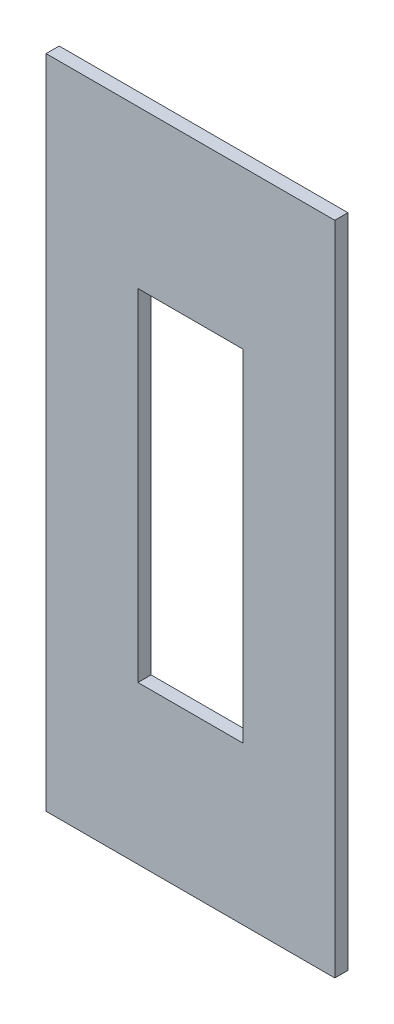
ISO-10303-21;
HEADER;
FILE_DESCRIPTION(('STEP AP214'),'2;1');
FILE_NAME('part.step','',(''),(''),'','','');
FILE_SCHEMA(('AUTOMOTIVE_DESIGN { 1 0 10303 214 1 1 1 1 }'));
ENDSEC;
DATA;
#1=APPLICATION_CONTEXT('core data for automotive mechanical design processes');
#2=APPLICATION_PROTOCOL_DEFINITION('international standard','automotive_design',2000,#1);
#3=PRODUCT_CONTEXT('',#1,'mechanical');
#4=PRODUCT('Part','Part','',(#3));
#5=PRODUCT_RELATED_PRODUCT_CATEGORY('part','',(#4));
#6=PRODUCT_DEFINITION_FORMATION('','',#4);
#7=PRODUCT_DEFINITION_CONTEXT('part definition',#1,'design');
#8=PRODUCT_DEFINITION('design','',#6,#7);
#9=PRODUCT_DEFINITION_SHAPE('','',#8);
#10=(LENGTH_UNIT() NAMED_UNIT(*) SI_UNIT(.MILLI.,.METRE.));
#11=(NAMED_UNIT(*) PLANE_ANGLE_UNIT() SI_UNIT($,.RADIAN.));
#12=(NAMED_UNIT(*) SI_UNIT($,.STERADIAN.) SOLID_ANGLE_UNIT());
#13=UNCERTAINTY_MEASURE_WITH_UNIT(LENGTH_MEASURE(1.E-05),#10,'distance_accuracy_value','');
#14=(GEOMETRIC_REPRESENTATION_CONTEXT(3) GLOBAL_UNCERTAINTY_ASSIGNED_CONTEXT((#13)) GLOBAL_UNIT_ASSIGNED_CONTEXT((#10,
#11,#12)) REPRESENTATION_CONTEXT('',''));
#15=CARTESIAN_POINT('',(0.,0.,0.));
#16=DIRECTION('',(0.,0.,1.));
#17=DIRECTION('',(1.,0.,0.));
#18=AXIS2_PLACEMENT_3D('',#15,#16,#17);
#19=CARTESIAN_POINT('',(0.,6.5,0.5));
#20=DIRECTION('',(0.,1.,0.));
#21=DIRECTION('',(0.,0.,1.));
#22=AXIS2_PLACEMENT_3D('',#19,#20,#21);
#23=PLANE('',#22);
#24=DIRECTION('',(1.,0.,0.));
#25=VECTOR('',#24,1.);
#26=CARTESIAN_POINT('',(0.,6.5,0.));
#27=LINE('',#26,#25);
#28=CARTESIAN_POINT('',(-2.,6.5,0.));
#29=VERTEX_POINT('',#28);
#30=CARTESIAN_POINT('',(2.,6.5,0.));
#31=VERTEX_POINT('',#30);
#32=EDGE_CURVE('E140',#29,#31,#27,.T.);
#33=ORIENTED_EDGE('',*,*,#32,.T.);
#34=DIRECTION('',(0.,0.,-1.));
#35=VECTOR('',#34,1.);
#36=CARTESIAN_POINT('',(2.,6.5,0.5));
#37=LINE('',#36,#35);
#38=CARTESIAN_POINT('',(2.,6.5,0.5));
#39=VERTEX_POINT('',#38);
#40=EDGE_CURVE('E11',#39,#31,#37,.T.);
#41=ORIENTED_EDGE('',*,*,#40,.F.);
#42=DIRECTION('',(1.,0.,0.));
#43=VECTOR('',#42,1.);
#44=CARTESIAN_POINT('',(0.,6.5,0.5));
#45=LINE('',#44,#43);
#46=CARTESIAN_POINT('',(-2.,6.5,0.5));
#47=VERTEX_POINT('',#46);
#48=EDGE_CURVE('E112',#47,#39,#45,.T.);
#49=ORIENTED_EDGE('',*,*,#48,.F.);
#50=DIRECTION('',(0.,0.,-1.));
#51=VECTOR('',#50,1.);
#52=CARTESIAN_POINT('',(-2.,6.5,0.5));
#53=LINE('',#52,#51);
#54=EDGE_CURVE('E52',#47,#29,#53,.T.);
#55=ORIENTED_EDGE('',*,*,#54,.T.);
#56=EDGE_LOOP('',(#33,#41,#49,#55));
#57=FACE_BOUND('',#56,.T.);
#58=ADVANCED_FACE('F33',(#57),#23,.F.);
#59=CARTESIAN_POINT('',(2.,-21.3859500636481,0.5));
#60=DIRECTION('',(1.,0.,0.));
#61=DIRECTION('',(0.,1.,0.));
#62=AXIS2_PLACEMENT_3D('',#59,#60,#61);
#63=PLANE('',#62);
#64=DIRECTION('',(0.,-1.,0.));
#65=VECTOR('',#64,1.);
#66=CARTESIAN_POINT('',(2.,-21.3859500636481,0.));
#67=LINE('',#66,#65);
#68=CARTESIAN_POINT('',(2.,-6.5,0.));
#69=VERTEX_POINT('',#68);
#70=EDGE_CURVE('E118',#31,#69,#67,.T.);
#71=ORIENTED_EDGE('',*,*,#70,.T.);
#72=DIRECTION('',(0.,0.,-1.));
#73=VECTOR('',#72,1.);
#74=CARTESIAN_POINT('',(2.,-6.5,0.5));
#75=LINE('',#74,#73);
#76=CARTESIAN_POINT('',(2.,-6.5,0.5));
#77=VERTEX_POINT('',#76);
#78=EDGE_CURVE('E43',#77,#69,#75,.T.);
#79=ORIENTED_EDGE('',*,*,#78,.F.);
#80=DIRECTION('',(0.,-1.,0.));
#81=VECTOR('',#80,1.);
#82=CARTESIAN_POINT('',(2.,-21.3859500636481,0.5));
#83=LINE('',#82,#81);
#84=EDGE_CURVE('E106',#39,#77,#83,.T.);
#85=ORIENTED_EDGE('',*,*,#84,.F.);
#86=ORIENTED_EDGE('',*,*,#40,.T.);
#87=EDGE_LOOP('',(#71,#79,#85,#86));
#88=FACE_BOUND('',#87,.T.);
#89=ADVANCED_FACE('F117',(#88),#63,.F.);
#90=CARTESIAN_POINT('',(0.,-6.5,0.5));
#91=DIRECTION('',(0.,1.,0.));
#92=DIRECTION('',(0.,0.,1.));
#93=AXIS2_PLACEMENT_3D('',#90,#91,#92);
#94=PLANE('',#93);
#95=DIRECTION('',(1.,0.,0.));
#96=VECTOR('',#95,1.);
#97=CARTESIAN_POINT('',(0.,-6.5,0.));
#98=LINE('',#97,#96);
#99=CARTESIAN_POINT('',(-2.,-6.5,0.));
#100=VERTEX_POINT('',#99);
#101=EDGE_CURVE('E143',#100,#69,#98,.T.);
#102=ORIENTED_EDGE('',*,*,#101,.F.);
#103=DIRECTION('',(0.,0.,-1.));
#104=VECTOR('',#103,1.);
#105=CARTESIAN_POINT('',(-2.,-6.5,0.5));
#106=LINE('',#105,#104);
#107=CARTESIAN_POINT('',(-2.,-6.5,0.5));
#108=VERTEX_POINT('',#107);
#109=EDGE_CURVE('E78',#108,#100,#106,.T.);
#110=ORIENTED_EDGE('',*,*,#109,.F.);
#111=DIRECTION('',(1.,0.,0.));
#112=VECTOR('',#111,1.);
#113=CARTESIAN_POINT('',(0.,-6.5,0.5));
#114=LINE('',#113,#112);
#115=EDGE_CURVE('E111',#108,#77,#114,.T.);
#116=ORIENTED_EDGE('',*,*,#115,.T.);
#117=ORIENTED_EDGE('',*,*,#78,.T.);
#118=EDGE_LOOP('',(#102,#110,#116,#117));
#119=FACE_BOUND('',#118,.T.);
#120=ADVANCED_FACE('F122',(#119),#94,.T.);
#121=CARTESIAN_POINT('',(5.5,-21.3859500636481,0.5));
#122=DIRECTION('',(1.,0.,0.));
#123=DIRECTION('',(0.,1.,0.));
#124=AXIS2_PLACEMENT_3D('',#121,#122,#123);
#125=PLANE('',#124);
#126=DIRECTION('',(0.,-1.,0.));
#127=VECTOR('',#126,1.);
#128=CARTESIAN_POINT('',(5.5,-21.3859500636481,0.));
#129=LINE('',#128,#127);
#130=CARTESIAN_POINT('',(5.5,12.5,0.));
#131=VERTEX_POINT('',#130);
#132=CARTESIAN_POINT('',(5.5,-12.5,0.));
#133=VERTEX_POINT('',#132);
#134=EDGE_CURVE('E129',#131,#133,#129,.T.);
#135=ORIENTED_EDGE('',*,*,#134,.F.);
#136=DIRECTION('',(0.,0.,-1.));
#137=VECTOR('',#136,1.);
#138=CARTESIAN_POINT('',(5.5,12.5,0.5));
#139=LINE('',#138,#137);
#140=CARTESIAN_POINT('',(5.5,12.5,0.5));
#141=VERTEX_POINT('',#140);
#142=EDGE_CURVE('E37',#141,#131,#139,.T.);
#143=ORIENTED_EDGE('',*,*,#142,.F.);
#144=DIRECTION('',(0.,-1.,0.));
#145=VECTOR('',#144,1.);
#146=CARTESIAN_POINT('',(5.5,-21.3859500636481,0.5));
#147=LINE('',#146,#145);
#148=CARTESIAN_POINT('',(5.5,-12.5,0.5));
#149=VERTEX_POINT('',#148);
#150=EDGE_CURVE('E148',#141,#149,#147,.T.);
#151=ORIENTED_EDGE('',*,*,#150,.T.);
#152=DIRECTION('',(0.,0.,-1.));
#153=VECTOR('',#152,1.);
#154=CARTESIAN_POINT('',(5.5,-12.5,0.5));
#155=LINE('',#154,#153);
#156=EDGE_CURVE('E125',#149,#133,#155,.T.);
#157=ORIENTED_EDGE('',*,*,#156,.T.);
#158=EDGE_LOOP('',(#135,#143,#151,#157));
#159=FACE_BOUND('',#158,.T.);
#160=ADVANCED_FACE('F35',(#159),#125,.T.);
#161=CARTESIAN_POINT('',(0.,12.5,0.5));
#162=DIRECTION('',(0.,1.,0.));
#163=DIRECTION('',(-1.,0.,0.));
#164=AXIS2_PLACEMENT_3D('',#161,#162,#163);
#165=PLANE('',#164);
#166=DIRECTION('',(1.,0.,0.));
#167=VECTOR('',#166,1.);
#168=CARTESIAN_POINT('',(0.,12.5,0.));
#169=LINE('',#168,#167);
#170=CARTESIAN_POINT('',(-5.5,12.5,0.));
#171=VERTEX_POINT('',#170);
#172=EDGE_CURVE('E132',#171,#131,#169,.T.);
#173=ORIENTED_EDGE('',*,*,#172,.F.);
#174=DIRECTION('',(0.,0.,-1.));
#175=VECTOR('',#174,1.);
#176=CARTESIAN_POINT('',(-5.5,12.5,0.5));
#177=LINE('',#176,#175);
#178=CARTESIAN_POINT('',(-5.5,12.5,0.5));
#179=VERTEX_POINT('',#178);
#180=EDGE_CURVE('E154',#179,#171,#177,.T.);
#181=ORIENTED_EDGE('',*,*,#180,.F.);
#182=DIRECTION('',(1.,0.,0.));
#183=VECTOR('',#182,1.);
#184=CARTESIAN_POINT('',(0.,12.5,0.5));
#185=LINE('',#184,#183);
#186=EDGE_CURVE('E163',#179,#141,#185,.T.);
#187=ORIENTED_EDGE('',*,*,#186,.T.);
#188=ORIENTED_EDGE('',*,*,#142,.T.);
#189=EDGE_LOOP('',(#173,#181,#187,#188));
#190=FACE_BOUND('',#189,.T.);
#191=ADVANCED_FACE('F161',(#190),#165,.T.);
#192=CARTESIAN_POINT('',(-5.5,-21.3859500636481,0.5));
#193=DIRECTION('',(1.,0.,0.));
#194=DIRECTION('',(0.,1.,0.));
#195=AXIS2_PLACEMENT_3D('',#192,#193,#194);
#196=PLANE('',#195);
#197=DIRECTION('',(0.,-1.,0.));
#198=VECTOR('',#197,1.);
#199=CARTESIAN_POINT('',(-5.5,-21.3859500636481,0.));
#200=LINE('',#199,#198);
#201=CARTESIAN_POINT('',(-5.5,-12.5,0.));
#202=VERTEX_POINT('',#201);
#203=EDGE_CURVE('E135',#171,#202,#200,.T.);
#204=ORIENTED_EDGE('',*,*,#203,.T.);
#205=DIRECTION('',(0.,0.,-1.));
#206=VECTOR('',#205,1.);
#207=CARTESIAN_POINT('',(-5.5,-12.5,0.5));
#208=LINE('',#207,#206);
#209=CARTESIAN_POINT('',(-5.5,-12.5,0.5));
#210=VERTEX_POINT('',#209);
#211=EDGE_CURVE('E152',#210,#202,#208,.T.);
#212=ORIENTED_EDGE('',*,*,#211,.F.);
#213=DIRECTION('',(0.,-1.,0.));
#214=VECTOR('',#213,1.);
#215=CARTESIAN_POINT('',(-5.5,-21.3859500636481,0.5));
#216=LINE('',#215,#214);
#217=EDGE_CURVE('E176',#179,#210,#216,.T.);
#218=ORIENTED_EDGE('',*,*,#217,.F.);
#219=ORIENTED_EDGE('',*,*,#180,.T.);
#220=EDGE_LOOP('',(#204,#212,#218,#219));
#221=FACE_BOUND('',#220,.T.);
#222=ADVANCED_FACE('F170',(#221),#196,.F.);
#223=CARTESIAN_POINT('',(0.,-12.5,0.5));
#224=DIRECTION('',(0.,1.,0.));
#225=DIRECTION('',(-1.,0.,0.));
#226=AXIS2_PLACEMENT_3D('',#223,#224,#225);
#227=PLANE('',#226);
#228=DIRECTION('',(1.,0.,0.));
#229=VECTOR('',#228,1.);
#230=CARTESIAN_POINT('',(0.,-12.5,0.));
#231=LINE('',#230,#229);
#232=EDGE_CURVE('E137',#202,#133,#231,.T.);
#233=ORIENTED_EDGE('',*,*,#232,.T.);
#234=ORIENTED_EDGE('',*,*,#156,.F.);
#235=DIRECTION('',(1.,0.,0.));
#236=VECTOR('',#235,1.);
#237=CARTESIAN_POINT('',(0.,-12.5,0.5));
#238=LINE('',#237,#236);
#239=EDGE_CURVE('E174',#210,#149,#238,.T.);
#240=ORIENTED_EDGE('',*,*,#239,.F.);
#241=ORIENTED_EDGE('',*,*,#211,.T.);
#242=EDGE_LOOP('',(#233,#234,#240,#241));
#243=FACE_BOUND('',#242,.T.);
#244=ADVANCED_FACE('F173',(#243),#227,.F.);
#245=CARTESIAN_POINT('',(-2.,-21.3859500636481,0.5));
#246=DIRECTION('',(1.,0.,0.));
#247=DIRECTION('',(0.,1.,0.));
#248=AXIS2_PLACEMENT_3D('',#245,#246,#247);
#249=PLANE('',#248);
#250=DIRECTION('',(0.,-1.,0.));
#251=VECTOR('',#250,1.);
#252=CARTESIAN_POINT('',(-2.,-21.3859500636481,0.));
#253=LINE('',#252,#251);
#254=EDGE_CURVE('E145',#29,#100,#253,.T.);
#255=ORIENTED_EDGE('',*,*,#254,.F.);
#256=ORIENTED_EDGE('',*,*,#54,.F.);
#257=DIRECTION('',(0.,-1.,0.));
#258=VECTOR('',#257,1.);
#259=CARTESIAN_POINT('',(-2.,-21.3859500636481,0.5));
#260=LINE('',#259,#258);
#261=EDGE_CURVE('E123',#47,#108,#260,.T.);
#262=ORIENTED_EDGE('',*,*,#261,.T.);
#263=ORIENTED_EDGE('',*,*,#109,.T.);
#264=EDGE_LOOP('',(#255,#256,#262,#263));
#265=FACE_BOUND('',#264,.T.);
#266=ADVANCED_FACE('F182',(#265),#249,.T.);
#267=CARTESIAN_POINT('',(0.,-21.3859500636481,0.5));
#268=DIRECTION('',(0.,0.,1.));
#269=DIRECTION('',(1.,0.,0.));
#270=AXIS2_PLACEMENT_3D('',#267,#268,#269);
#271=PLANE('',#270);
#272=ORIENTED_EDGE('',*,*,#150,.F.);
#273=ORIENTED_EDGE('',*,*,#186,.F.);
#274=ORIENTED_EDGE('',*,*,#217,.T.);
#275=ORIENTED_EDGE('',*,*,#239,.T.);
#276=EDGE_LOOP('',(#272,#273,#274,#275));
#277=FACE_BOUND('',#276,.T.);
#278=ORIENTED_EDGE('',*,*,#48,.T.);
#279=ORIENTED_EDGE('',*,*,#84,.T.);
#280=ORIENTED_EDGE('',*,*,#115,.F.);
#281=ORIENTED_EDGE('',*,*,#261,.F.);
#282=EDGE_LOOP('',(#278,#279,#280,#281));
#283=FACE_BOUND('',#282,.T.);
#284=ADVANCED_FACE('F108',(#277,#283),#271,.T.);
#285=CARTESIAN_POINT('',(0.,-21.3859500636481,0.));
#286=DIRECTION('',(0.,0.,1.));
#287=DIRECTION('',(1.,0.,0.));
#288=AXIS2_PLACEMENT_3D('',#285,#286,#287);
#289=PLANE('',#288);
#290=ORIENTED_EDGE('',*,*,#134,.T.);
#291=ORIENTED_EDGE('',*,*,#232,.F.);
#292=ORIENTED_EDGE('',*,*,#203,.F.);
#293=ORIENTED_EDGE('',*,*,#172,.T.);
#294=EDGE_LOOP('',(#290,#291,#292,#293));
#295=FACE_BOUND('',#294,.T.);
#296=ORIENTED_EDGE('',*,*,#32,.F.);
#297=ORIENTED_EDGE('',*,*,#254,.T.);
#298=ORIENTED_EDGE('',*,*,#101,.T.);
#299=ORIENTED_EDGE('',*,*,#70,.F.);
#300=EDGE_LOOP('',(#296,#297,#298,#299));
#301=FACE_BOUND('',#300,.T.);
#302=ADVANCED_FACE('F167',(#295,#301),#289,.F.);
#303=CLOSED_SHELL('',(#58,#89,#120,#160,#191,#222,#244,#266,#284,#302));
#304=MANIFOLD_SOLID_BREP('B2',#303);
#305=ADVANCED_BREP_SHAPE_REPRESENTATION('',(#18,#304),#14);
#306=SHAPE_DEFINITION_REPRESENTATION(#9,#305);
ENDSEC;
END-ISO-10303-21;
